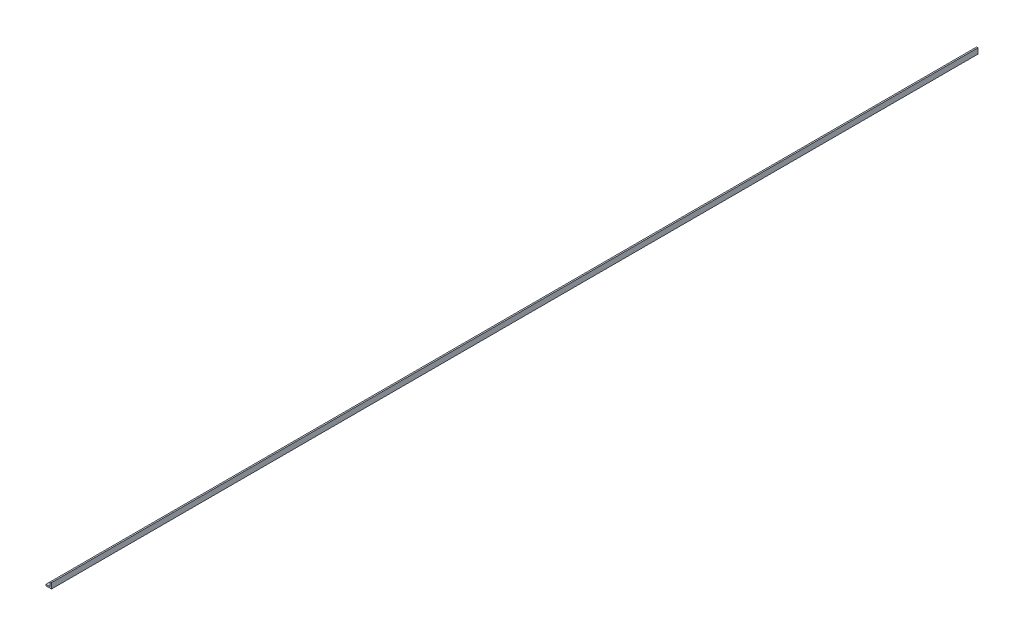
ISO-10303-21;
HEADER;
FILE_DESCRIPTION(('STEP AP214'),'2;1');
FILE_NAME('part.step','',(''),(''),'','','');
FILE_SCHEMA(('AUTOMOTIVE_DESIGN { 1 0 10303 214 1 1 1 1 }'));
ENDSEC;
DATA;
#1=APPLICATION_CONTEXT('core data for automotive mechanical design processes');
#2=APPLICATION_PROTOCOL_DEFINITION('international standard','automotive_design',2000,#1);
#3=PRODUCT_CONTEXT('',#1,'mechanical');
#4=PRODUCT('Part','Part','',(#3));
#5=PRODUCT_RELATED_PRODUCT_CATEGORY('part','',(#4));
#6=PRODUCT_DEFINITION_FORMATION('','',#4);
#7=PRODUCT_DEFINITION_CONTEXT('part definition',#1,'design');
#8=PRODUCT_DEFINITION('design','',#6,#7);
#9=PRODUCT_DEFINITION_SHAPE('','',#8);
#10=(LENGTH_UNIT() NAMED_UNIT(*) SI_UNIT(.MILLI.,.METRE.));
#11=(NAMED_UNIT(*) PLANE_ANGLE_UNIT() SI_UNIT($,.RADIAN.));
#12=(NAMED_UNIT(*) SI_UNIT($,.STERADIAN.) SOLID_ANGLE_UNIT());
#13=UNCERTAINTY_MEASURE_WITH_UNIT(LENGTH_MEASURE(1.E-05),#10,'distance_accuracy_value','');
#14=(GEOMETRIC_REPRESENTATION_CONTEXT(3) GLOBAL_UNCERTAINTY_ASSIGNED_CONTEXT((#13)) GLOBAL_UNIT_ASSIGNED_CONTEXT((#10,
#11,#12)) REPRESENTATION_CONTEXT('',''));
#15=CARTESIAN_POINT('',(0.,0.,0.));
#16=DIRECTION('',(0.,0.,1.));
#17=DIRECTION('',(1.,0.,0.));
#18=AXIS2_PLACEMENT_3D('',#15,#16,#17);
#19=CARTESIAN_POINT('',(-6.35,0.,1066.8));
#20=DIRECTION('',(1.,0.,0.));
#21=DIRECTION('',(0.,0.,-1.));
#22=AXIS2_PLACEMENT_3D('',#19,#20,#21);
#23=PLANE('',#22);
#24=DIRECTION('',(0.,-1.,0.));
#25=VECTOR('',#24,1.);
#26=CARTESIAN_POINT('',(-6.35,0.,-1066.8));
#27=LINE('',#26,#25);
#28=CARTESIAN_POINT('',(-6.35,3.175,-1066.8));
#29=VERTEX_POINT('',#28);
#30=CARTESIAN_POINT('',(-6.35,0.,-1066.8));
#31=VERTEX_POINT('',#30);
#32=EDGE_CURVE('E120',#29,#31,#27,.T.);
#33=ORIENTED_EDGE('',*,*,#32,.T.);
#34=DIRECTION('',(0.,0.,-1.));
#35=VECTOR('',#34,1.);
#36=CARTESIAN_POINT('',(-6.35,0.,1066.8));
#37=LINE('',#36,#35);
#38=CARTESIAN_POINT('',(-6.35,0.,1066.8));
#39=VERTEX_POINT('',#38);
#40=EDGE_CURVE('E11',#39,#31,#37,.T.);
#41=ORIENTED_EDGE('',*,*,#40,.F.);
#42=DIRECTION('',(0.,-1.,0.));
#43=VECTOR('',#42,1.);
#44=CARTESIAN_POINT('',(-6.35,0.,1066.8));
#45=LINE('',#44,#43);
#46=CARTESIAN_POINT('',(-6.35,3.175,1066.8));
#47=VERTEX_POINT('',#46);
#48=EDGE_CURVE('E130',#47,#39,#45,.T.);
#49=ORIENTED_EDGE('',*,*,#48,.F.);
#50=DIRECTION('',(0.,0.,-1.));
#51=VECTOR('',#50,1.);
#52=CARTESIAN_POINT('',(-6.35,3.175,1066.8));
#53=LINE('',#52,#51);
#54=EDGE_CURVE('E116',#47,#29,#53,.T.);
#55=ORIENTED_EDGE('',*,*,#54,.T.);
#56=EDGE_LOOP('',(#33,#41,#49,#55));
#57=FACE_BOUND('',#56,.T.);
#58=ADVANCED_FACE('F36',(#57),#23,.F.);
#59=CARTESIAN_POINT('',(-6.35,0.,1066.8));
#60=DIRECTION('',(0.,1.,0.));
#61=DIRECTION('',(0.,0.,1.));
#62=AXIS2_PLACEMENT_3D('',#59,#60,#61);
#63=PLANE('',#62);
#64=DIRECTION('',(1.,0.,0.));
#65=VECTOR('',#64,1.);
#66=CARTESIAN_POINT('',(-6.35,0.,-1066.8));
#67=LINE('',#66,#65);
#68=CARTESIAN_POINT('',(6.35,0.,-1066.8));
#69=VERTEX_POINT('',#68);
#70=EDGE_CURVE('E123',#31,#69,#67,.T.);
#71=ORIENTED_EDGE('',*,*,#70,.T.);
#72=DIRECTION('',(0.,0.,-1.));
#73=VECTOR('',#72,1.);
#74=CARTESIAN_POINT('',(6.35,0.,1066.8));
#75=LINE('',#74,#73);
#76=CARTESIAN_POINT('',(6.35,0.,1066.8));
#77=VERTEX_POINT('',#76);
#78=EDGE_CURVE('E44',#77,#69,#75,.T.);
#79=ORIENTED_EDGE('',*,*,#78,.F.);
#80=DIRECTION('',(1.,0.,0.));
#81=VECTOR('',#80,1.);
#82=CARTESIAN_POINT('',(-6.35,0.,1066.8));
#83=LINE('',#82,#81);
#84=EDGE_CURVE('E89',#39,#77,#83,.T.);
#85=ORIENTED_EDGE('',*,*,#84,.F.);
#86=ORIENTED_EDGE('',*,*,#40,.T.);
#87=EDGE_LOOP('',(#71,#79,#85,#86));
#88=FACE_BOUND('',#87,.T.);
#89=ADVANCED_FACE('F154',(#88),#63,.F.);
#90=CARTESIAN_POINT('',(6.35,0.,1066.8));
#91=DIRECTION('',(-1.,0.,0.));
#92=DIRECTION('',(0.,0.,1.));
#93=AXIS2_PLACEMENT_3D('',#90,#91,#92);
#94=PLANE('',#93);
#95=DIRECTION('',(0.,1.,0.));
#96=VECTOR('',#95,1.);
#97=CARTESIAN_POINT('',(6.35,0.,-1066.8));
#98=LINE('',#97,#96);
#99=CARTESIAN_POINT('',(6.35,12.7,-1066.8));
#100=VERTEX_POINT('',#99);
#101=EDGE_CURVE('E125',#69,#100,#98,.T.);
#102=ORIENTED_EDGE('',*,*,#101,.T.);
#103=DIRECTION('',(0.,0.,-1.));
#104=VECTOR('',#103,1.);
#105=CARTESIAN_POINT('',(6.35,12.7,1066.8));
#106=LINE('',#105,#104);
#107=CARTESIAN_POINT('',(6.35,12.7,1066.8));
#108=VERTEX_POINT('',#107);
#109=EDGE_CURVE('E111',#108,#100,#106,.T.);
#110=ORIENTED_EDGE('',*,*,#109,.F.);
#111=DIRECTION('',(0.,1.,0.));
#112=VECTOR('',#111,1.);
#113=CARTESIAN_POINT('',(6.35,0.,1066.8));
#114=LINE('',#113,#112);
#115=EDGE_CURVE('E102',#77,#108,#114,.T.);
#116=ORIENTED_EDGE('',*,*,#115,.F.);
#117=ORIENTED_EDGE('',*,*,#78,.T.);
#118=EDGE_LOOP('',(#102,#110,#116,#117));
#119=FACE_BOUND('',#118,.T.);
#120=ADVANCED_FACE('F136',(#119),#94,.F.);
#121=CARTESIAN_POINT('',(6.35,12.7,1066.8));
#122=DIRECTION('',(0.,-1.,0.));
#123=DIRECTION('',(0.,0.,-1.));
#124=AXIS2_PLACEMENT_3D('',#121,#122,#123);
#125=PLANE('',#124);
#126=DIRECTION('',(-1.,0.,0.));
#127=VECTOR('',#126,1.);
#128=CARTESIAN_POINT('',(6.35,12.7,-1066.8));
#129=LINE('',#128,#127);
#130=CARTESIAN_POINT('',(3.175,12.7,-1066.8));
#131=VERTEX_POINT('',#130);
#132=EDGE_CURVE('E110',#100,#131,#129,.T.);
#133=ORIENTED_EDGE('',*,*,#132,.T.);
#134=DIRECTION('',(0.,0.,-1.));
#135=VECTOR('',#134,1.);
#136=CARTESIAN_POINT('',(3.175,12.7,1066.8));
#137=LINE('',#136,#135);
#138=CARTESIAN_POINT('',(3.175,12.7,1066.8));
#139=VERTEX_POINT('',#138);
#140=EDGE_CURVE('E107',#139,#131,#137,.T.);
#141=ORIENTED_EDGE('',*,*,#140,.F.);
#142=DIRECTION('',(-1.,0.,0.));
#143=VECTOR('',#142,1.);
#144=CARTESIAN_POINT('',(6.35,12.7,1066.8));
#145=LINE('',#144,#143);
#146=EDGE_CURVE('E96',#108,#139,#145,.T.);
#147=ORIENTED_EDGE('',*,*,#146,.F.);
#148=ORIENTED_EDGE('',*,*,#109,.T.);
#149=EDGE_LOOP('',(#133,#141,#147,#148));
#150=FACE_BOUND('',#149,.T.);
#151=ADVANCED_FACE('F108',(#150),#125,.F.);
#152=CARTESIAN_POINT('',(3.175,12.7,1066.8));
#153=DIRECTION('',(1.,0.,0.));
#154=DIRECTION('',(0.,1.,0.));
#155=AXIS2_PLACEMENT_3D('',#152,#153,#154);
#156=PLANE('',#155);
#157=DIRECTION('',(0.,-1.,0.));
#158=VECTOR('',#157,1.);
#159=CARTESIAN_POINT('',(3.175,12.7,-1066.8));
#160=LINE('',#159,#158);
#161=CARTESIAN_POINT('',(3.175,3.175,-1066.8));
#162=VERTEX_POINT('',#161);
#163=EDGE_CURVE('E75',#131,#162,#160,.T.);
#164=ORIENTED_EDGE('',*,*,#163,.T.);
#165=DIRECTION('',(0.,0.,-1.));
#166=VECTOR('',#165,1.);
#167=CARTESIAN_POINT('',(3.175,3.175,1066.8));
#168=LINE('',#167,#166);
#169=CARTESIAN_POINT('',(3.175,3.175,1066.8));
#170=VERTEX_POINT('',#169);
#171=EDGE_CURVE('E112',#170,#162,#168,.T.);
#172=ORIENTED_EDGE('',*,*,#171,.F.);
#173=DIRECTION('',(0.,-1.,0.));
#174=VECTOR('',#173,1.);
#175=CARTESIAN_POINT('',(3.175,12.7,1066.8));
#176=LINE('',#175,#174);
#177=EDGE_CURVE('E100',#139,#170,#176,.T.);
#178=ORIENTED_EDGE('',*,*,#177,.F.);
#179=ORIENTED_EDGE('',*,*,#140,.T.);
#180=EDGE_LOOP('',(#164,#172,#178,#179));
#181=FACE_BOUND('',#180,.T.);
#182=ADVANCED_FACE('F114',(#181),#156,.F.);
#183=CARTESIAN_POINT('',(3.175,3.175,1066.8));
#184=DIRECTION('',(0.,-1.,0.));
#185=DIRECTION('',(1.,0.,0.));
#186=AXIS2_PLACEMENT_3D('',#183,#184,#185);
#187=PLANE('',#186);
#188=DIRECTION('',(-1.,0.,0.));
#189=VECTOR('',#188,1.);
#190=CARTESIAN_POINT('',(3.175,3.175,-1066.8));
#191=LINE('',#190,#189);
#192=EDGE_CURVE('E81',#162,#29,#191,.T.);
#193=ORIENTED_EDGE('',*,*,#192,.T.);
#194=ORIENTED_EDGE('',*,*,#54,.F.);
#195=DIRECTION('',(-1.,0.,0.));
#196=VECTOR('',#195,1.);
#197=CARTESIAN_POINT('',(3.175,3.175,1066.8));
#198=LINE('',#197,#196);
#199=EDGE_CURVE('E52',#170,#47,#198,.T.);
#200=ORIENTED_EDGE('',*,*,#199,.F.);
#201=ORIENTED_EDGE('',*,*,#171,.T.);
#202=EDGE_LOOP('',(#193,#194,#200,#201));
#203=FACE_BOUND('',#202,.T.);
#204=ADVANCED_FACE('F143',(#203),#187,.F.);
#205=CARTESIAN_POINT('',(-6.35,3.175,1066.8));
#206=DIRECTION('',(0.,0.,1.));
#207=DIRECTION('',(1.,0.,0.));
#208=AXIS2_PLACEMENT_3D('',#205,#206,#207);
#209=PLANE('',#208);
#210=ORIENTED_EDGE('',*,*,#48,.T.);
#211=ORIENTED_EDGE('',*,*,#84,.T.);
#212=ORIENTED_EDGE('',*,*,#115,.T.);
#213=ORIENTED_EDGE('',*,*,#146,.T.);
#214=ORIENTED_EDGE('',*,*,#177,.T.);
#215=ORIENTED_EDGE('',*,*,#199,.T.);
#216=EDGE_LOOP('',(#210,#211,#212,#213,#214,#215));
#217=FACE_BOUND('',#216,.T.);
#218=ADVANCED_FACE('F98',(#217),#209,.T.);
#219=CARTESIAN_POINT('',(-6.35,3.175,-1066.8));
#220=DIRECTION('',(0.,0.,1.));
#221=DIRECTION('',(1.,0.,0.));
#222=AXIS2_PLACEMENT_3D('',#219,#220,#221);
#223=PLANE('',#222);
#224=ORIENTED_EDGE('',*,*,#32,.F.);
#225=ORIENTED_EDGE('',*,*,#192,.F.);
#226=ORIENTED_EDGE('',*,*,#163,.F.);
#227=ORIENTED_EDGE('',*,*,#132,.F.);
#228=ORIENTED_EDGE('',*,*,#101,.F.);
#229=ORIENTED_EDGE('',*,*,#70,.F.);
#230=EDGE_LOOP('',(#224,#225,#226,#227,#228,#229));
#231=FACE_BOUND('',#230,.T.);
#232=ADVANCED_FACE('F139',(#231),#223,.F.);
#233=CLOSED_SHELL('',(#58,#89,#120,#151,#182,#204,#218,#232));
#234=MANIFOLD_SOLID_BREP('B2',#233);
#235=ADVANCED_BREP_SHAPE_REPRESENTATION('',(#18,#234),#14);
#236=SHAPE_DEFINITION_REPRESENTATION(#9,#235);
ENDSEC;
END-ISO-10303-21;
